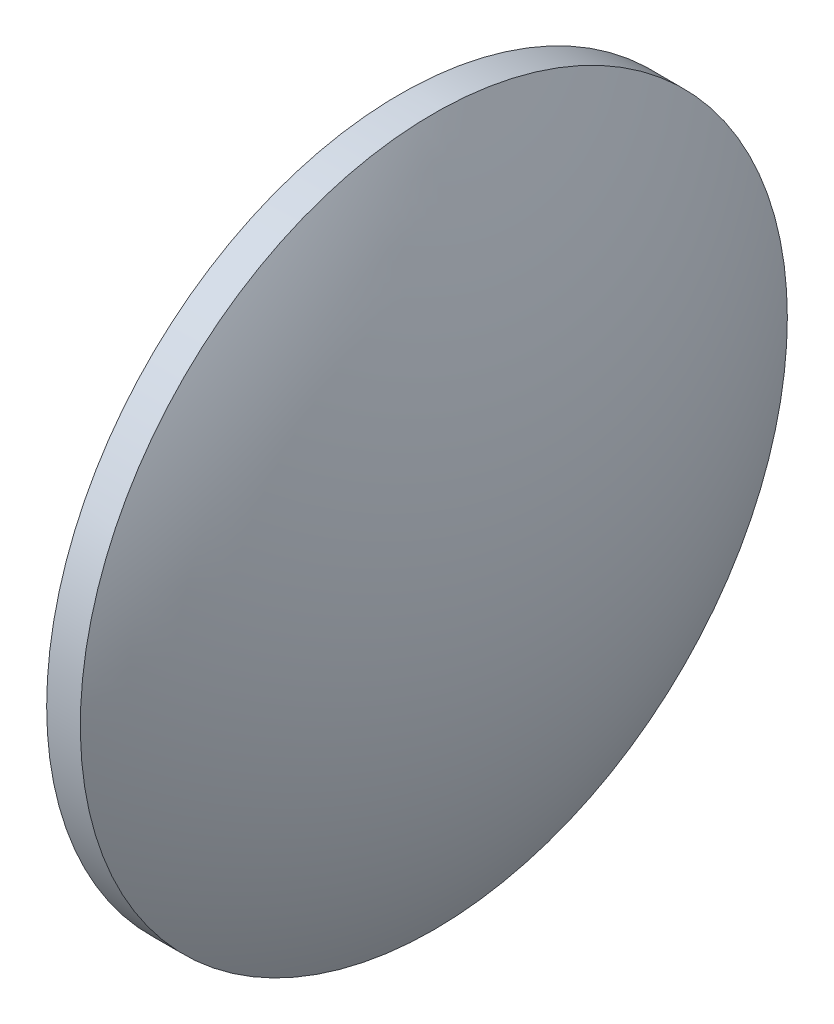
ISO-10303-21;
HEADER;
FILE_DESCRIPTION(('STEP AP214'),'2;1');
FILE_NAME('part.step','',(''),(''),'','','');
FILE_SCHEMA(('AUTOMOTIVE_DESIGN { 1 0 10303 214 1 1 1 1 }'));
ENDSEC;
DATA;
#1=APPLICATION_CONTEXT('core data for automotive mechanical design processes');
#2=APPLICATION_PROTOCOL_DEFINITION('international standard','automotive_design',2000,#1);
#3=PRODUCT_CONTEXT('',#1,'mechanical');
#4=PRODUCT('Part','Part','',(#3));
#5=PRODUCT_RELATED_PRODUCT_CATEGORY('part','',(#4));
#6=PRODUCT_DEFINITION_FORMATION('','',#4);
#7=PRODUCT_DEFINITION_CONTEXT('part definition',#1,'design');
#8=PRODUCT_DEFINITION('design','',#6,#7);
#9=PRODUCT_DEFINITION_SHAPE('','',#8);
#10=(LENGTH_UNIT() NAMED_UNIT(*) SI_UNIT(.MILLI.,.METRE.));
#11=(NAMED_UNIT(*) PLANE_ANGLE_UNIT() SI_UNIT($,.RADIAN.));
#12=(NAMED_UNIT(*) SI_UNIT($,.STERADIAN.) SOLID_ANGLE_UNIT());
#13=UNCERTAINTY_MEASURE_WITH_UNIT(LENGTH_MEASURE(1.E-05),#10,'distance_accuracy_value','');
#14=(GEOMETRIC_REPRESENTATION_CONTEXT(3) GLOBAL_UNCERTAINTY_ASSIGNED_CONTEXT((#13)) GLOBAL_UNIT_ASSIGNED_CONTEXT((#10,
#11,#12)) REPRESENTATION_CONTEXT('',''));
#15=CARTESIAN_POINT('',(0.,0.,0.));
#16=DIRECTION('',(0.,0.,1.));
#17=DIRECTION('',(1.,0.,0.));
#18=AXIS2_PLACEMENT_3D('',#15,#16,#17);
#19=CARTESIAN_POINT('',(172.64095975392,130.467109852824,0.));
#20=DIRECTION('',(1.,0.,0.));
#21=DIRECTION('',(0.,-1.,0.));
#22=AXIS2_PLACEMENT_3D('',#19,#20,#21);
#23=SPHERICAL_SURFACE('',#22,64.5343544457977);
#24=CARTESIAN_POINT('',(228.965314199717,130.467109852824,0.));
#25=DIRECTION('',(1.,0.,0.));
#26=DIRECTION('',(0.,0.,-1.));
#27=AXIS2_PLACEMENT_3D('',#24,#25,#26);
#28=CIRCLE('',#27,31.5);
#29=CARTESIAN_POINT('',(228.965314199717,130.467109852824,-31.5));
#30=VERTEX_POINT('',#29);
#31=EDGE_CURVE('E10',#30,#30,#28,.T.);
#32=ORIENTED_EDGE('',*,*,#31,.T.);
#33=EDGE_LOOP('',(#32));
#34=FACE_BOUND('',#33,.T.);
#35=ADVANCED_FACE('F35',(#34),#23,.T.);
#36=CARTESIAN_POINT('',(237.175314199717,130.467109852824,0.));
#37=DIRECTION('',(1.,0.,0.));
#38=DIRECTION('',(0.,0.,-1.));
#39=AXIS2_PLACEMENT_3D('',#36,#37,#38);
#40=CYLINDRICAL_SURFACE('',#39,31.5);
#41=CARTESIAN_POINT('',(225.965314199717,130.467109852824,0.));
#42=DIRECTION('',(1.,0.,0.));
#43=DIRECTION('',(0.,0.,-1.));
#44=AXIS2_PLACEMENT_3D('',#41,#42,#43);
#45=CIRCLE('',#44,31.5);
#46=CARTESIAN_POINT('',(225.965314199717,130.467109852824,-31.5));
#47=VERTEX_POINT('',#46);
#48=EDGE_CURVE('E41',#47,#47,#45,.T.);
#49=ORIENTED_EDGE('',*,*,#48,.T.);
#50=EDGE_LOOP('',(#49));
#51=FACE_BOUND('',#50,.T.);
#52=ORIENTED_EDGE('',*,*,#31,.F.);
#53=EDGE_LOOP('',(#52));
#54=FACE_BOUND('',#53,.T.);
#55=ADVANCED_FACE('F47',(#51,#54),#40,.T.);
#56=CARTESIAN_POINT('',(225.965314199717,130.467109852824,0.));
#57=DIRECTION('',(-1.,0.,0.));
#58=DIRECTION('',(0.,0.,1.));
#59=AXIS2_PLACEMENT_3D('',#56,#57,#58);
#60=PLANE('',#59);
#61=ORIENTED_EDGE('',*,*,#48,.F.);
#62=EDGE_LOOP('',(#61));
#63=FACE_BOUND('',#62,.T.);
#64=ADVANCED_FACE('F50',(#63),#60,.T.);
#65=CLOSED_SHELL('',(#35,#55,#64));
#66=MANIFOLD_SOLID_BREP('B2',#65);
#67=ADVANCED_BREP_SHAPE_REPRESENTATION('',(#18,#66),#14);
#68=SHAPE_DEFINITION_REPRESENTATION(#9,#67);
ENDSEC;
END-ISO-10303-21;
